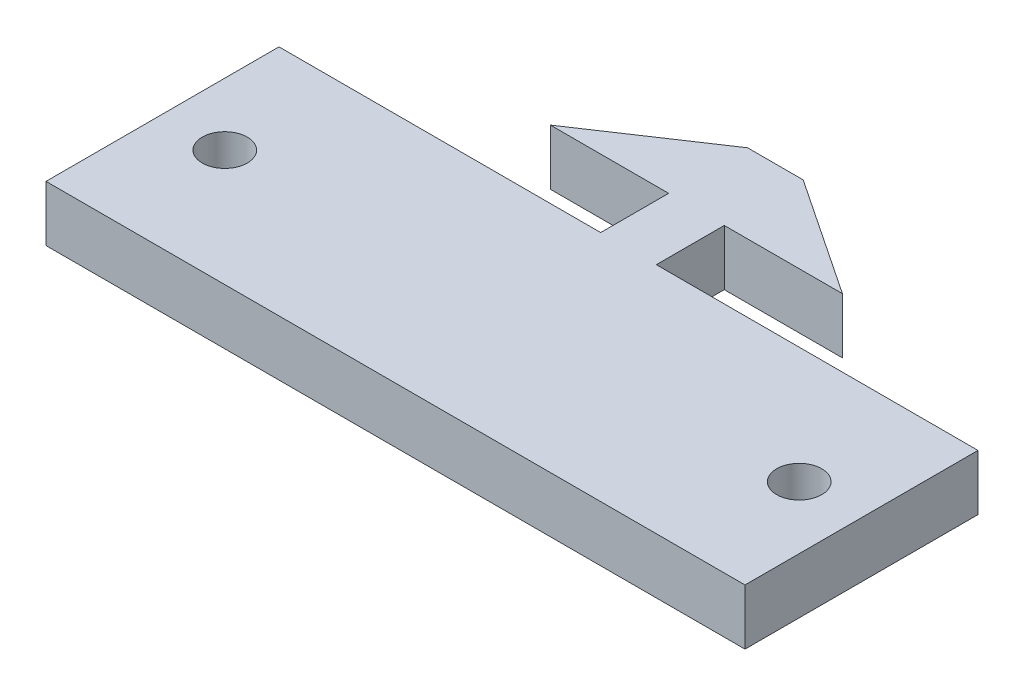
ISO-10303-21;
HEADER;
FILE_DESCRIPTION(('STEP AP214'),'2;1');
FILE_NAME('part.step','',(''),(''),'','','');
FILE_SCHEMA(('AUTOMOTIVE_DESIGN { 1 0 10303 214 1 1 1 1 }'));
ENDSEC;
DATA;
#1=APPLICATION_CONTEXT('core data for automotive mechanical design processes');
#2=APPLICATION_PROTOCOL_DEFINITION('international standard','automotive_design',2000,#1);
#3=PRODUCT_CONTEXT('',#1,'mechanical');
#4=PRODUCT('Part','Part','',(#3));
#5=PRODUCT_RELATED_PRODUCT_CATEGORY('part','',(#4));
#6=PRODUCT_DEFINITION_FORMATION('','',#4);
#7=PRODUCT_DEFINITION_CONTEXT('part definition',#1,'design');
#8=PRODUCT_DEFINITION('design','',#6,#7);
#9=PRODUCT_DEFINITION_SHAPE('','',#8);
#10=(LENGTH_UNIT() NAMED_UNIT(*) SI_UNIT(.MILLI.,.METRE.));
#11=(NAMED_UNIT(*) PLANE_ANGLE_UNIT() SI_UNIT($,.RADIAN.));
#12=(NAMED_UNIT(*) SI_UNIT($,.STERADIAN.) SOLID_ANGLE_UNIT());
#13=UNCERTAINTY_MEASURE_WITH_UNIT(LENGTH_MEASURE(1.E-05),#10,'distance_accuracy_value','');
#14=(GEOMETRIC_REPRESENTATION_CONTEXT(3) GLOBAL_UNCERTAINTY_ASSIGNED_CONTEXT((#13)) GLOBAL_UNIT_ASSIGNED_CONTEXT((#10,
#11,#12)) REPRESENTATION_CONTEXT('',''));
#15=CARTESIAN_POINT('',(0.,0.,0.));
#16=DIRECTION('',(0.,0.,1.));
#17=DIRECTION('',(1.,0.,0.));
#18=AXIS2_PLACEMENT_3D('',#15,#16,#17);
#19=CARTESIAN_POINT('',(0.,3.5814,17.1874988));
#20=DIRECTION('',(0.,0.,-1.));
#21=DIRECTION('',(-1.,0.,0.));
#22=AXIS2_PLACEMENT_3D('',#19,#20,#21);
#23=PLANE('',#22);
#24=DIRECTION('',(1.,0.,0.));
#25=VECTOR('',#24,1.);
#26=CARTESIAN_POINT('',(0.,0.,17.1874988));
#27=LINE('',#26,#25);
#28=CARTESIAN_POINT('',(-22.5,0.,17.1874988));
#29=VERTEX_POINT('',#28);
#30=CARTESIAN_POINT('',(22.5,0.,17.1874988));
#31=VERTEX_POINT('',#30);
#32=EDGE_CURVE('E157',#29,#31,#27,.T.);
#33=ORIENTED_EDGE('',*,*,#32,.T.);
#34=DIRECTION('',(0.,-1.,0.));
#35=VECTOR('',#34,1.);
#36=CARTESIAN_POINT('',(22.5,3.5814,17.1874988));
#37=LINE('',#36,#35);
#38=CARTESIAN_POINT('',(22.5,3.5814,17.1874988));
#39=VERTEX_POINT('',#38);
#40=EDGE_CURVE('E11',#39,#31,#37,.T.);
#41=ORIENTED_EDGE('',*,*,#40,.F.);
#42=DIRECTION('',(1.,0.,0.));
#43=VECTOR('',#42,1.);
#44=CARTESIAN_POINT('',(0.,3.5814,17.1874988));
#45=LINE('',#44,#43);
#46=CARTESIAN_POINT('',(-22.5,3.5814,17.1874988));
#47=VERTEX_POINT('',#46);
#48=EDGE_CURVE('E188',#47,#39,#45,.T.);
#49=ORIENTED_EDGE('',*,*,#48,.F.);
#50=DIRECTION('',(0.,-1.,0.));
#51=VECTOR('',#50,1.);
#52=CARTESIAN_POINT('',(-22.5,3.5814,17.1874988));
#53=LINE('',#52,#51);
#54=EDGE_CURVE('E156',#47,#29,#53,.T.);
#55=ORIENTED_EDGE('',*,*,#54,.T.);
#56=EDGE_LOOP('',(#33,#41,#49,#55));
#57=FACE_BOUND('',#56,.T.);
#58=ADVANCED_FACE('F35',(#57),#23,.F.);
#59=CARTESIAN_POINT('',(22.5,3.5814,0.));
#60=DIRECTION('',(-1.,0.,0.));
#61=DIRECTION('',(0.,0.,1.));
#62=AXIS2_PLACEMENT_3D('',#59,#60,#61);
#63=PLANE('',#62);
#64=DIRECTION('',(0.,0.,-1.));
#65=VECTOR('',#64,1.);
#66=CARTESIAN_POINT('',(22.5,0.,0.));
#67=LINE('',#66,#65);
#68=CARTESIAN_POINT('',(22.5,0.,2.1874988));
#69=VERTEX_POINT('',#68);
#70=EDGE_CURVE('E160',#31,#69,#67,.T.);
#71=ORIENTED_EDGE('',*,*,#70,.T.);
#72=DIRECTION('',(0.,-1.,0.));
#73=VECTOR('',#72,1.);
#74=CARTESIAN_POINT('',(22.5,3.5814,2.1874988));
#75=LINE('',#74,#73);
#76=CARTESIAN_POINT('',(22.5,3.5814,2.1874988));
#77=VERTEX_POINT('',#76);
#78=EDGE_CURVE('E43',#77,#69,#75,.T.);
#79=ORIENTED_EDGE('',*,*,#78,.F.);
#80=DIRECTION('',(0.,0.,-1.));
#81=VECTOR('',#80,1.);
#82=CARTESIAN_POINT('',(22.5,3.5814,0.));
#83=LINE('',#82,#81);
#84=EDGE_CURVE('E105',#39,#77,#83,.T.);
#85=ORIENTED_EDGE('',*,*,#84,.F.);
#86=ORIENTED_EDGE('',*,*,#40,.T.);
#87=EDGE_LOOP('',(#71,#79,#85,#86));
#88=FACE_BOUND('',#87,.T.);
#89=ADVANCED_FACE('F209',(#88),#63,.F.);
#90=CARTESIAN_POINT('',(0.,3.5814,2.1874988));
#91=DIRECTION('',(0.,0.,-1.));
#92=DIRECTION('',(-1.,0.,0.));
#93=AXIS2_PLACEMENT_3D('',#90,#91,#92);
#94=PLANE('',#93);
#95=DIRECTION('',(1.,0.,0.));
#96=VECTOR('',#95,1.);
#97=CARTESIAN_POINT('',(0.,0.,2.1874988));
#98=LINE('',#97,#96);
#99=CARTESIAN_POINT('',(1.7907,0.,2.1874988));
#100=VERTEX_POINT('',#99);
#101=EDGE_CURVE('E164',#100,#69,#98,.T.);
#102=ORIENTED_EDGE('',*,*,#101,.F.);
#103=DIRECTION('',(0.,-1.,0.));
#104=VECTOR('',#103,1.);
#105=CARTESIAN_POINT('',(1.7907,3.5814,2.1874988));
#106=LINE('',#105,#104);
#107=CARTESIAN_POINT('',(1.7907,3.5814,2.1874988));
#108=VERTEX_POINT('',#107);
#109=EDGE_CURVE('E202',#108,#100,#106,.T.);
#110=ORIENTED_EDGE('',*,*,#109,.F.);
#111=DIRECTION('',(1.,0.,0.));
#112=VECTOR('',#111,1.);
#113=CARTESIAN_POINT('',(0.,3.5814,2.1874988));
#114=LINE('',#113,#112);
#115=EDGE_CURVE('E208',#108,#77,#114,.T.);
#116=ORIENTED_EDGE('',*,*,#115,.T.);
#117=ORIENTED_EDGE('',*,*,#78,.T.);
#118=EDGE_LOOP('',(#102,#110,#116,#117));
#119=FACE_BOUND('',#118,.T.);
#120=ADVANCED_FACE('F206',(#119),#94,.T.);
#121=CARTESIAN_POINT('',(1.7907,3.5814,0.));
#122=DIRECTION('',(-1.,0.,0.));
#123=DIRECTION('',(0.,0.,1.));
#124=AXIS2_PLACEMENT_3D('',#121,#122,#123);
#125=PLANE('',#124);
#126=DIRECTION('',(0.,0.,-1.));
#127=VECTOR('',#126,1.);
#128=CARTESIAN_POINT('',(1.7907,0.,0.));
#129=LINE('',#128,#127);
#130=CARTESIAN_POINT('',(1.7907,0.,-2.1874988));
#131=VERTEX_POINT('',#130);
#132=EDGE_CURVE('E167',#100,#131,#129,.T.);
#133=ORIENTED_EDGE('',*,*,#132,.T.);
#134=DIRECTION('',(0.,-1.,0.));
#135=VECTOR('',#134,1.);
#136=CARTESIAN_POINT('',(1.7907,3.5814,-2.1874988));
#137=LINE('',#136,#135);
#138=CARTESIAN_POINT('',(1.7907,3.5814,-2.1874988));
#139=VERTEX_POINT('',#138);
#140=EDGE_CURVE('E200',#139,#131,#137,.T.);
#141=ORIENTED_EDGE('',*,*,#140,.F.);
#142=DIRECTION('',(0.,0.,-1.));
#143=VECTOR('',#142,1.);
#144=CARTESIAN_POINT('',(1.7907,3.5814,0.));
#145=LINE('',#144,#143);
#146=EDGE_CURVE('E221',#108,#139,#145,.T.);
#147=ORIENTED_EDGE('',*,*,#146,.F.);
#148=ORIENTED_EDGE('',*,*,#109,.T.);
#149=EDGE_LOOP('',(#133,#141,#147,#148));
#150=FACE_BOUND('',#149,.T.);
#151=ADVANCED_FACE('F218',(#150),#125,.F.);
#152=CARTESIAN_POINT('',(0.,3.5814,-2.1874988));
#153=DIRECTION('',(0.,0.,1.));
#154=DIRECTION('',(1.,0.,0.));
#155=AXIS2_PLACEMENT_3D('',#152,#153,#154);
#156=PLANE('',#155);
#157=DIRECTION('',(-1.,0.,0.));
#158=VECTOR('',#157,1.);
#159=CARTESIAN_POINT('',(0.,0.,-2.1874988));
#160=LINE('',#159,#158);
#161=CARTESIAN_POINT('',(9.398,0.,-2.1874988));
#162=VERTEX_POINT('',#161);
#163=EDGE_CURVE('E170',#162,#131,#160,.T.);
#164=ORIENTED_EDGE('',*,*,#163,.F.);
#165=DIRECTION('',(0.,-1.,0.));
#166=VECTOR('',#165,1.);
#167=CARTESIAN_POINT('',(9.398,3.5814,-2.1874988));
#168=LINE('',#167,#166);
#169=CARTESIAN_POINT('',(9.398,3.5814,-2.1874988));
#170=VERTEX_POINT('',#169);
#171=EDGE_CURVE('E198',#170,#162,#168,.T.);
#172=ORIENTED_EDGE('',*,*,#171,.F.);
#173=DIRECTION('',(-1.,0.,0.));
#174=VECTOR('',#173,1.);
#175=CARTESIAN_POINT('',(0.,3.5814,-2.1874988));
#176=LINE('',#175,#174);
#177=EDGE_CURVE('E223',#170,#139,#176,.T.);
#178=ORIENTED_EDGE('',*,*,#177,.T.);
#179=ORIENTED_EDGE('',*,*,#140,.T.);
#180=EDGE_LOOP('',(#164,#172,#178,#179));
#181=FACE_BOUND('',#180,.T.);
#182=ADVANCED_FACE('F269',(#181),#156,.T.);
#183=CARTESIAN_POINT('',(3.90863686168685,3.5814,-5.85318370037606));
#184=DIRECTION('',(0.55534080959066,0.,-0.831622862362014));
#185=DIRECTION('',(-0.831622862362014,0.,-0.55534080959066));
#186=AXIS2_PLACEMENT_3D('',#183,#184,#185);
#187=PLANE('',#186);
#188=DIRECTION('',(0.831622862362014,0.,0.55534080959066));
#189=VECTOR('',#188,1.);
#190=CARTESIAN_POINT('',(3.90863686168685,0.,-5.85318370037606));
#191=LINE('',#190,#189);
#192=CARTESIAN_POINT('',(1.7907,0.,-7.2674988));
#193=VERTEX_POINT('',#192);
#194=EDGE_CURVE('E173',#193,#162,#191,.T.);
#195=ORIENTED_EDGE('',*,*,#194,.F.);
#196=DIRECTION('',(0.,-1.,0.));
#197=VECTOR('',#196,1.);
#198=CARTESIAN_POINT('',(1.7907,3.5814,-7.2674988));
#199=LINE('',#198,#197);
#200=CARTESIAN_POINT('',(1.7907,3.5814,-7.2674988));
#201=VERTEX_POINT('',#200);
#202=EDGE_CURVE('E196',#201,#193,#199,.T.);
#203=ORIENTED_EDGE('',*,*,#202,.F.);
#204=DIRECTION('',(0.831622862362014,0.,0.55534080959066));
#205=VECTOR('',#204,1.);
#206=CARTESIAN_POINT('',(3.90863686168685,3.5814,-5.85318370037606));
#207=LINE('',#206,#205);
#208=EDGE_CURVE('E230',#201,#170,#207,.T.);
#209=ORIENTED_EDGE('',*,*,#208,.T.);
#210=ORIENTED_EDGE('',*,*,#171,.T.);
#211=EDGE_LOOP('',(#195,#203,#209,#210));
#212=FACE_BOUND('',#211,.T.);
#213=ADVANCED_FACE('F272',(#212),#187,.T.);
#214=CARTESIAN_POINT('',(0.,3.5814,-7.2674988));
#215=DIRECTION('',(0.,0.,-1.));
#216=DIRECTION('',(-1.,0.,0.));
#217=AXIS2_PLACEMENT_3D('',#214,#215,#216);
#218=PLANE('',#217);
#219=DIRECTION('',(1.,0.,0.));
#220=VECTOR('',#219,1.);
#221=CARTESIAN_POINT('',(0.,0.,-7.2674988));
#222=LINE('',#221,#220);
#223=CARTESIAN_POINT('',(-1.7907,0.,-7.2674988));
#224=VERTEX_POINT('',#223);
#225=EDGE_CURVE('E176',#224,#193,#222,.T.);
#226=ORIENTED_EDGE('',*,*,#225,.F.);
#227=DIRECTION('',(0.,-1.,0.));
#228=VECTOR('',#227,1.);
#229=CARTESIAN_POINT('',(-1.7907,3.5814,-7.2674988));
#230=LINE('',#229,#228);
#231=CARTESIAN_POINT('',(-1.7907,3.5814,-7.2674988));
#232=VERTEX_POINT('',#231);
#233=EDGE_CURVE('E194',#232,#224,#230,.T.);
#234=ORIENTED_EDGE('',*,*,#233,.F.);
#235=DIRECTION('',(1.,0.,0.));
#236=VECTOR('',#235,1.);
#237=CARTESIAN_POINT('',(0.,3.5814,-7.2674988));
#238=LINE('',#237,#236);
#239=EDGE_CURVE('E233',#232,#201,#238,.T.);
#240=ORIENTED_EDGE('',*,*,#239,.T.);
#241=ORIENTED_EDGE('',*,*,#202,.T.);
#242=EDGE_LOOP('',(#226,#234,#240,#241));
#243=FACE_BOUND('',#242,.T.);
#244=ADVANCED_FACE('F276',(#243),#218,.T.);
#245=CARTESIAN_POINT('',(-3.90863686168685,3.5814,-5.85318370037606));
#246=DIRECTION('',(-0.55534080959066,0.,-0.831622862362014));
#247=DIRECTION('',(-0.831622862362014,0.,0.55534080959066));
#248=AXIS2_PLACEMENT_3D('',#245,#246,#247);
#249=PLANE('',#248);
#250=DIRECTION('',(0.831622862362014,0.,-0.55534080959066));
#251=VECTOR('',#250,1.);
#252=CARTESIAN_POINT('',(-3.90863686168685,0.,-5.85318370037606));
#253=LINE('',#252,#251);
#254=CARTESIAN_POINT('',(-9.398,0.,-2.1874988));
#255=VERTEX_POINT('',#254);
#256=EDGE_CURVE('E179',#255,#224,#253,.T.);
#257=ORIENTED_EDGE('',*,*,#256,.F.);
#258=DIRECTION('',(0.,-1.,0.));
#259=VECTOR('',#258,1.);
#260=CARTESIAN_POINT('',(-9.398,3.5814,-2.1874988));
#261=LINE('',#260,#259);
#262=CARTESIAN_POINT('',(-9.398,3.5814,-2.1874988));
#263=VERTEX_POINT('',#262);
#264=EDGE_CURVE('E192',#263,#255,#261,.T.);
#265=ORIENTED_EDGE('',*,*,#264,.F.);
#266=DIRECTION('',(0.831622862362014,0.,-0.55534080959066));
#267=VECTOR('',#266,1.);
#268=CARTESIAN_POINT('',(-3.90863686168685,3.5814,-5.85318370037606));
#269=LINE('',#268,#267);
#270=EDGE_CURVE('E151',#263,#232,#269,.T.);
#271=ORIENTED_EDGE('',*,*,#270,.T.);
#272=ORIENTED_EDGE('',*,*,#233,.T.);
#273=EDGE_LOOP('',(#257,#265,#271,#272));
#274=FACE_BOUND('',#273,.T.);
#275=ADVANCED_FACE('F238',(#274),#249,.T.);
#276=CARTESIAN_POINT('',(0.,3.5814,-2.1874988));
#277=DIRECTION('',(0.,0.,1.));
#278=DIRECTION('',(1.,0.,0.));
#279=AXIS2_PLACEMENT_3D('',#276,#277,#278);
#280=PLANE('',#279);
#281=DIRECTION('',(-1.,0.,0.));
#282=VECTOR('',#281,1.);
#283=CARTESIAN_POINT('',(0.,0.,-2.1874988));
#284=LINE('',#283,#282);
#285=CARTESIAN_POINT('',(-1.7907,0.,-2.1874988));
#286=VERTEX_POINT('',#285);
#287=EDGE_CURVE('E182',#286,#255,#284,.T.);
#288=ORIENTED_EDGE('',*,*,#287,.F.);
#289=DIRECTION('',(0.,-1.,0.));
#290=VECTOR('',#289,1.);
#291=CARTESIAN_POINT('',(-1.7907,3.5814,-2.1874988));
#292=LINE('',#291,#290);
#293=CARTESIAN_POINT('',(-1.7907,3.5814,-2.1874988));
#294=VERTEX_POINT('',#293);
#295=EDGE_CURVE('E139',#294,#286,#292,.T.);
#296=ORIENTED_EDGE('',*,*,#295,.F.);
#297=DIRECTION('',(-1.,0.,0.));
#298=VECTOR('',#297,1.);
#299=CARTESIAN_POINT('',(0.,3.5814,-2.1874988));
#300=LINE('',#299,#298);
#301=EDGE_CURVE('E149',#294,#263,#300,.T.);
#302=ORIENTED_EDGE('',*,*,#301,.T.);
#303=ORIENTED_EDGE('',*,*,#264,.T.);
#304=EDGE_LOOP('',(#288,#296,#302,#303));
#305=FACE_BOUND('',#304,.T.);
#306=ADVANCED_FACE('F244',(#305),#280,.T.);
#307=CARTESIAN_POINT('',(-1.7907,3.5814,0.));
#308=DIRECTION('',(-1.,0.,0.));
#309=DIRECTION('',(0.,0.,1.));
#310=AXIS2_PLACEMENT_3D('',#307,#308,#309);
#311=PLANE('',#310);
#312=DIRECTION('',(0.,0.,-1.));
#313=VECTOR('',#312,1.);
#314=CARTESIAN_POINT('',(-1.7907,0.,0.));
#315=LINE('',#314,#313);
#316=CARTESIAN_POINT('',(-1.7907,0.,2.1874988));
#317=VERTEX_POINT('',#316);
#318=EDGE_CURVE('E138',#317,#286,#315,.T.);
#319=ORIENTED_EDGE('',*,*,#318,.F.);
#320=DIRECTION('',(0.,-1.,0.));
#321=VECTOR('',#320,1.);
#322=CARTESIAN_POINT('',(-1.7907,3.5814,2.1874988));
#323=LINE('',#322,#321);
#324=CARTESIAN_POINT('',(-1.7907,3.5814,2.1874988));
#325=VERTEX_POINT('',#324);
#326=EDGE_CURVE('E132',#325,#317,#323,.T.);
#327=ORIENTED_EDGE('',*,*,#326,.F.);
#328=DIRECTION('',(0.,0.,-1.));
#329=VECTOR('',#328,1.);
#330=CARTESIAN_POINT('',(-1.7907,3.5814,0.));
#331=LINE('',#330,#329);
#332=EDGE_CURVE('E136',#325,#294,#331,.T.);
#333=ORIENTED_EDGE('',*,*,#332,.T.);
#334=ORIENTED_EDGE('',*,*,#295,.T.);
#335=EDGE_LOOP('',(#319,#327,#333,#334));
#336=FACE_BOUND('',#335,.T.);
#337=ADVANCED_FACE('F134',(#336),#311,.T.);
#338=CARTESIAN_POINT('',(0.,3.5814,2.1874988));
#339=DIRECTION('',(0.,0.,1.));
#340=DIRECTION('',(1.,0.,0.));
#341=AXIS2_PLACEMENT_3D('',#338,#339,#340);
#342=PLANE('',#341);
#343=DIRECTION('',(-1.,0.,0.));
#344=VECTOR('',#343,1.);
#345=CARTESIAN_POINT('',(0.,0.,2.1874988));
#346=LINE('',#345,#344);
#347=CARTESIAN_POINT('',(-22.5,0.,2.1874988));
#348=VERTEX_POINT('',#347);
#349=EDGE_CURVE('E91',#317,#348,#346,.T.);
#350=ORIENTED_EDGE('',*,*,#349,.T.);
#351=DIRECTION('',(0.,-1.,0.));
#352=VECTOR('',#351,1.);
#353=CARTESIAN_POINT('',(-22.5,3.5814,2.1874988));
#354=LINE('',#353,#352);
#355=CARTESIAN_POINT('',(-22.5,3.5814,2.1874988));
#356=VERTEX_POINT('',#355);
#357=EDGE_CURVE('E140',#356,#348,#354,.T.);
#358=ORIENTED_EDGE('',*,*,#357,.F.);
#359=DIRECTION('',(-1.,0.,0.));
#360=VECTOR('',#359,1.);
#361=CARTESIAN_POINT('',(0.,3.5814,2.1874988));
#362=LINE('',#361,#360);
#363=EDGE_CURVE('E142',#325,#356,#362,.T.);
#364=ORIENTED_EDGE('',*,*,#363,.F.);
#365=ORIENTED_EDGE('',*,*,#326,.T.);
#366=EDGE_LOOP('',(#350,#358,#364,#365));
#367=FACE_BOUND('',#366,.T.);
#368=ADVANCED_FACE('F143',(#367),#342,.F.);
#369=CARTESIAN_POINT('',(-22.5,3.5814,0.));
#370=DIRECTION('',(1.,0.,0.));
#371=DIRECTION('',(0.,0.,-1.));
#372=AXIS2_PLACEMENT_3D('',#369,#370,#371);
#373=PLANE('',#372);
#374=DIRECTION('',(0.,0.,1.));
#375=VECTOR('',#374,1.);
#376=CARTESIAN_POINT('',(-22.5,0.,0.));
#377=LINE('',#376,#375);
#378=EDGE_CURVE('E97',#348,#29,#377,.T.);
#379=ORIENTED_EDGE('',*,*,#378,.T.);
#380=ORIENTED_EDGE('',*,*,#54,.F.);
#381=DIRECTION('',(0.,0.,1.));
#382=VECTOR('',#381,1.);
#383=CARTESIAN_POINT('',(-22.5,3.5814,0.));
#384=LINE('',#383,#382);
#385=EDGE_CURVE('E51',#356,#47,#384,.T.);
#386=ORIENTED_EDGE('',*,*,#385,.F.);
#387=ORIENTED_EDGE('',*,*,#357,.T.);
#388=EDGE_LOOP('',(#379,#380,#386,#387));
#389=FACE_BOUND('',#388,.T.);
#390=ADVANCED_FACE('F247',(#389),#373,.F.);
#391=CARTESIAN_POINT('',(0.,3.5814,0.));
#392=DIRECTION('',(0.,1.,0.));
#393=DIRECTION('',(0.,0.,1.));
#394=AXIS2_PLACEMENT_3D('',#391,#392,#393);
#395=PLANE('',#394);
#396=CARTESIAN_POINT('',(-18.49,3.5814,9.6874988));
#397=DIRECTION('',(0.,1.,0.));
#398=DIRECTION('',(0.,0.,1.));
#399=AXIS2_PLACEMENT_3D('',#396,#397,#398);
#400=CIRCLE('',#399,1.45);
#401=CARTESIAN_POINT('',(-18.49,3.5814,11.1374988));
#402=VERTEX_POINT('',#401);
#403=EDGE_CURVE('E341',#402,#402,#400,.T.);
#404=ORIENTED_EDGE('',*,*,#403,.F.);
#405=EDGE_LOOP('',(#404));
#406=FACE_BOUND('',#405,.T.);
#407=CARTESIAN_POINT('',(18.49,3.5814,9.68749879999999));
#408=DIRECTION('',(0.,1.,0.));
#409=DIRECTION('',(0.,0.,1.));
#410=AXIS2_PLACEMENT_3D('',#407,#408,#409);
#411=CIRCLE('',#410,1.45);
#412=CARTESIAN_POINT('',(18.49,3.5814,11.1374988));
#413=VERTEX_POINT('',#412);
#414=EDGE_CURVE('E346',#413,#413,#411,.T.);
#415=ORIENTED_EDGE('',*,*,#414,.F.);
#416=EDGE_LOOP('',(#415));
#417=FACE_BOUND('',#416,.T.);
#418=ORIENTED_EDGE('',*,*,#48,.T.);
#419=ORIENTED_EDGE('',*,*,#84,.T.);
#420=ORIENTED_EDGE('',*,*,#115,.F.);
#421=ORIENTED_EDGE('',*,*,#146,.T.);
#422=ORIENTED_EDGE('',*,*,#177,.F.);
#423=ORIENTED_EDGE('',*,*,#208,.F.);
#424=ORIENTED_EDGE('',*,*,#239,.F.);
#425=ORIENTED_EDGE('',*,*,#270,.F.);
#426=ORIENTED_EDGE('',*,*,#301,.F.);
#427=ORIENTED_EDGE('',*,*,#332,.F.);
#428=ORIENTED_EDGE('',*,*,#363,.T.);
#429=ORIENTED_EDGE('',*,*,#385,.T.);
#430=EDGE_LOOP('',(#418,#419,#420,#421,#422,#423,#424,#425,#426,#427,#428,#429));
#431=FACE_BOUND('',#430,.T.);
#432=ADVANCED_FACE('F146',(#406,#417,#431),#395,.T.);
#433=CARTESIAN_POINT('',(0.,0.,0.));
#434=DIRECTION('',(0.,1.,0.));
#435=DIRECTION('',(0.,0.,1.));
#436=AXIS2_PLACEMENT_3D('',#433,#434,#435);
#437=PLANE('',#436);
#438=CARTESIAN_POINT('',(-18.49,0.,9.6874988));
#439=DIRECTION('',(0.,1.,0.));
#440=DIRECTION('',(0.,0.,1.));
#441=AXIS2_PLACEMENT_3D('',#438,#439,#440);
#442=CIRCLE('',#441,1.45);
#443=CARTESIAN_POINT('',(-18.49,0.,11.1374988));
#444=VERTEX_POINT('',#443);
#445=EDGE_CURVE('E161',#444,#444,#442,.T.);
#446=ORIENTED_EDGE('',*,*,#445,.T.);
#447=EDGE_LOOP('',(#446));
#448=FACE_BOUND('',#447,.T.);
#449=CARTESIAN_POINT('',(18.49,0.,9.68749879999999));
#450=DIRECTION('',(0.,1.,0.));
#451=DIRECTION('',(0.,0.,1.));
#452=AXIS2_PLACEMENT_3D('',#449,#450,#451);
#453=CIRCLE('',#452,1.45);
#454=CARTESIAN_POINT('',(18.49,0.,11.1374988));
#455=VERTEX_POINT('',#454);
#456=EDGE_CURVE('E342',#455,#455,#453,.T.);
#457=ORIENTED_EDGE('',*,*,#456,.T.);
#458=EDGE_LOOP('',(#457));
#459=FACE_BOUND('',#458,.T.);
#460=ORIENTED_EDGE('',*,*,#32,.F.);
#461=ORIENTED_EDGE('',*,*,#378,.F.);
#462=ORIENTED_EDGE('',*,*,#349,.F.);
#463=ORIENTED_EDGE('',*,*,#318,.T.);
#464=ORIENTED_EDGE('',*,*,#287,.T.);
#465=ORIENTED_EDGE('',*,*,#256,.T.);
#466=ORIENTED_EDGE('',*,*,#225,.T.);
#467=ORIENTED_EDGE('',*,*,#194,.T.);
#468=ORIENTED_EDGE('',*,*,#163,.T.);
#469=ORIENTED_EDGE('',*,*,#132,.F.);
#470=ORIENTED_EDGE('',*,*,#101,.T.);
#471=ORIENTED_EDGE('',*,*,#70,.F.);
#472=EDGE_LOOP('',(#460,#461,#462,#463,#464,#465,#466,#467,#468,#469,#470,#471));
#473=FACE_BOUND('',#472,.T.);
#474=ADVANCED_FACE('F214',(#448,#459,#473),#437,.F.);
#475=CARTESIAN_POINT('',(18.49,0.,9.68749879999999));
#476=DIRECTION('',(0.,1.,0.));
#477=DIRECTION('',(0.,0.,1.));
#478=AXIS2_PLACEMENT_3D('',#475,#476,#477);
#479=CYLINDRICAL_SURFACE('',#478,1.45);
#480=ORIENTED_EDGE('',*,*,#456,.F.);
#481=EDGE_LOOP('',(#480));
#482=FACE_BOUND('',#481,.T.);
#483=ORIENTED_EDGE('',*,*,#414,.T.);
#484=EDGE_LOOP('',(#483));
#485=FACE_BOUND('',#484,.T.);
#486=ADVANCED_FACE('F313',(#482,#485),#479,.F.);
#487=CARTESIAN_POINT('',(-18.49,0.,9.6874988));
#488=DIRECTION('',(0.,1.,0.));
#489=DIRECTION('',(0.,0.,1.));
#490=AXIS2_PLACEMENT_3D('',#487,#488,#489);
#491=CYLINDRICAL_SURFACE('',#490,1.45);
#492=ORIENTED_EDGE('',*,*,#445,.F.);
#493=EDGE_LOOP('',(#492));
#494=FACE_BOUND('',#493,.T.);
#495=ORIENTED_EDGE('',*,*,#403,.T.);
#496=EDGE_LOOP('',(#495));
#497=FACE_BOUND('',#496,.T.);
#498=ADVANCED_FACE('F322',(#494,#497),#491,.F.);
#499=CLOSED_SHELL('',(#58,#89,#120,#151,#182,#213,#244,#275,#306,#337,#368,#390,#432,#474,#486,#498));
#500=MANIFOLD_SOLID_BREP('B2',#499);
#501=ADVANCED_BREP_SHAPE_REPRESENTATION('',(#18,#500),#14);
#502=SHAPE_DEFINITION_REPRESENTATION(#9,#501);
ENDSEC;
END-ISO-10303-21;
